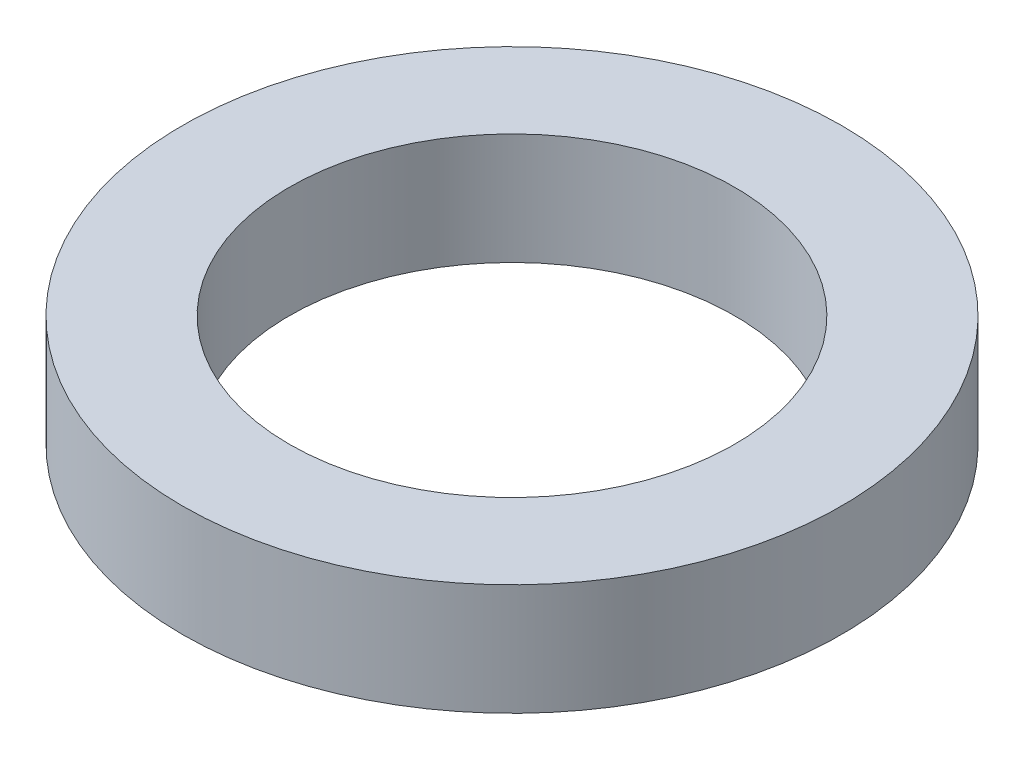
ISO-10303-21;
HEADER;
FILE_DESCRIPTION(('STEP AP214'),'2;1');
FILE_NAME('part.step','',(''),(''),'','','');
FILE_SCHEMA(('AUTOMOTIVE_DESIGN { 1 0 10303 214 1 1 1 1 }'));
ENDSEC;
DATA;
#1=APPLICATION_CONTEXT('core data for automotive mechanical design processes');
#2=APPLICATION_PROTOCOL_DEFINITION('international standard','automotive_design',2000,#1);
#3=PRODUCT_CONTEXT('',#1,'mechanical');
#4=PRODUCT('Part','Part','',(#3));
#5=PRODUCT_RELATED_PRODUCT_CATEGORY('part','',(#4));
#6=PRODUCT_DEFINITION_FORMATION('','',#4);
#7=PRODUCT_DEFINITION_CONTEXT('part definition',#1,'design');
#8=PRODUCT_DEFINITION('design','',#6,#7);
#9=PRODUCT_DEFINITION_SHAPE('','',#8);
#10=(LENGTH_UNIT() NAMED_UNIT(*) SI_UNIT(.MILLI.,.METRE.));
#11=(NAMED_UNIT(*) PLANE_ANGLE_UNIT() SI_UNIT($,.RADIAN.));
#12=(NAMED_UNIT(*) SI_UNIT($,.STERADIAN.) SOLID_ANGLE_UNIT());
#13=UNCERTAINTY_MEASURE_WITH_UNIT(LENGTH_MEASURE(1.E-05),#10,'distance_accuracy_value','');
#14=(GEOMETRIC_REPRESENTATION_CONTEXT(3) GLOBAL_UNCERTAINTY_ASSIGNED_CONTEXT((#13)) GLOBAL_UNIT_ASSIGNED_CONTEXT((#10,
#11,#12)) REPRESENTATION_CONTEXT('',''));
#15=CARTESIAN_POINT('',(0.,0.,0.));
#16=DIRECTION('',(0.,0.,1.));
#17=DIRECTION('',(1.,0.,0.));
#18=AXIS2_PLACEMENT_3D('',#15,#16,#17);
#19=CARTESIAN_POINT('',(0.,1.5875,0.));
#20=DIRECTION('',(0.,1.,0.));
#21=DIRECTION('',(0.,0.,1.));
#22=AXIS2_PLACEMENT_3D('',#19,#20,#21);
#23=PLANE('',#22);
#24=CARTESIAN_POINT('',(0.,1.5875,0.));
#25=DIRECTION('',(0.,1.,0.));
#26=DIRECTION('',(0.,0.,1.));
#27=AXIS2_PLACEMENT_3D('',#24,#25,#26);
#28=CIRCLE('',#27,4.699);
#29=CARTESIAN_POINT('',(0.,1.5875,4.699));
#30=VERTEX_POINT('',#29);
#31=EDGE_CURVE('E10',#30,#30,#28,.T.);
#32=ORIENTED_EDGE('',*,*,#31,.T.);
#33=EDGE_LOOP('',(#32));
#34=FACE_BOUND('',#33,.T.);
#35=CARTESIAN_POINT('',(0.,1.5875,0.));
#36=DIRECTION('',(0.,1.,0.));
#37=DIRECTION('',(0.,0.,1.));
#38=AXIS2_PLACEMENT_3D('',#35,#36,#37);
#39=CIRCLE('',#38,3.175);
#40=CARTESIAN_POINT('',(0.,1.5875,3.175));
#41=VERTEX_POINT('',#40);
#42=EDGE_CURVE('E42',#41,#41,#39,.T.);
#43=ORIENTED_EDGE('',*,*,#42,.F.);
#44=EDGE_LOOP('',(#43));
#45=FACE_BOUND('',#44,.T.);
#46=ADVANCED_FACE('F31',(#34,#45),#23,.T.);
#47=CARTESIAN_POINT('',(0.,0.,0.));
#48=DIRECTION('',(0.,1.,0.));
#49=DIRECTION('',(0.,0.,1.));
#50=AXIS2_PLACEMENT_3D('',#47,#48,#49);
#51=PLANE('',#50);
#52=CARTESIAN_POINT('',(0.,0.,0.));
#53=DIRECTION('',(0.,1.,0.));
#54=DIRECTION('',(0.,0.,1.));
#55=AXIS2_PLACEMENT_3D('',#52,#53,#54);
#56=CIRCLE('',#55,4.699);
#57=CARTESIAN_POINT('',(0.,0.,4.699));
#58=VERTEX_POINT('',#57);
#59=EDGE_CURVE('E35',#58,#58,#56,.T.);
#60=ORIENTED_EDGE('',*,*,#59,.F.);
#61=EDGE_LOOP('',(#60));
#62=FACE_BOUND('',#61,.T.);
#63=CARTESIAN_POINT('',(0.,0.,0.));
#64=DIRECTION('',(0.,1.,0.));
#65=DIRECTION('',(0.,0.,1.));
#66=AXIS2_PLACEMENT_3D('',#63,#64,#65);
#67=CIRCLE('',#66,3.175);
#68=CARTESIAN_POINT('',(0.,0.,3.175));
#69=VERTEX_POINT('',#68);
#70=EDGE_CURVE('E44',#69,#69,#67,.T.);
#71=ORIENTED_EDGE('',*,*,#70,.T.);
#72=EDGE_LOOP('',(#71));
#73=FACE_BOUND('',#72,.T.);
#74=ADVANCED_FACE('F54',(#62,#73),#51,.F.);
#75=CARTESIAN_POINT('',(0.,1.5875,0.));
#76=DIRECTION('',(0.,-1.,0.));
#77=DIRECTION('',(0.,0.,-1.));
#78=AXIS2_PLACEMENT_3D('',#75,#76,#77);
#79=CYLINDRICAL_SURFACE('',#78,4.699);
#80=ORIENTED_EDGE('',*,*,#31,.F.);
#81=EDGE_LOOP('',(#80));
#82=FACE_BOUND('',#81,.T.);
#83=ORIENTED_EDGE('',*,*,#59,.T.);
#84=EDGE_LOOP('',(#83));
#85=FACE_BOUND('',#84,.T.);
#86=ADVANCED_FACE('F33',(#82,#85),#79,.T.);
#87=CARTESIAN_POINT('',(0.,1.5875,0.));
#88=DIRECTION('',(0.,-1.,0.));
#89=DIRECTION('',(0.,0.,-1.));
#90=AXIS2_PLACEMENT_3D('',#87,#88,#89);
#91=CYLINDRICAL_SURFACE('',#90,3.175);
#92=ORIENTED_EDGE('',*,*,#42,.T.);
#93=EDGE_LOOP('',(#92));
#94=FACE_BOUND('',#93,.T.);
#95=ORIENTED_EDGE('',*,*,#70,.F.);
#96=EDGE_LOOP('',(#95));
#97=FACE_BOUND('',#96,.T.);
#98=ADVANCED_FACE('F50',(#94,#97),#91,.F.);
#99=CLOSED_SHELL('',(#46,#74,#86,#98));
#100=MANIFOLD_SOLID_BREP('B2',#99);
#101=ADVANCED_BREP_SHAPE_REPRESENTATION('',(#18,#100),#14);
#102=SHAPE_DEFINITION_REPRESENTATION(#9,#101);
ENDSEC;
END-ISO-10303-21;
